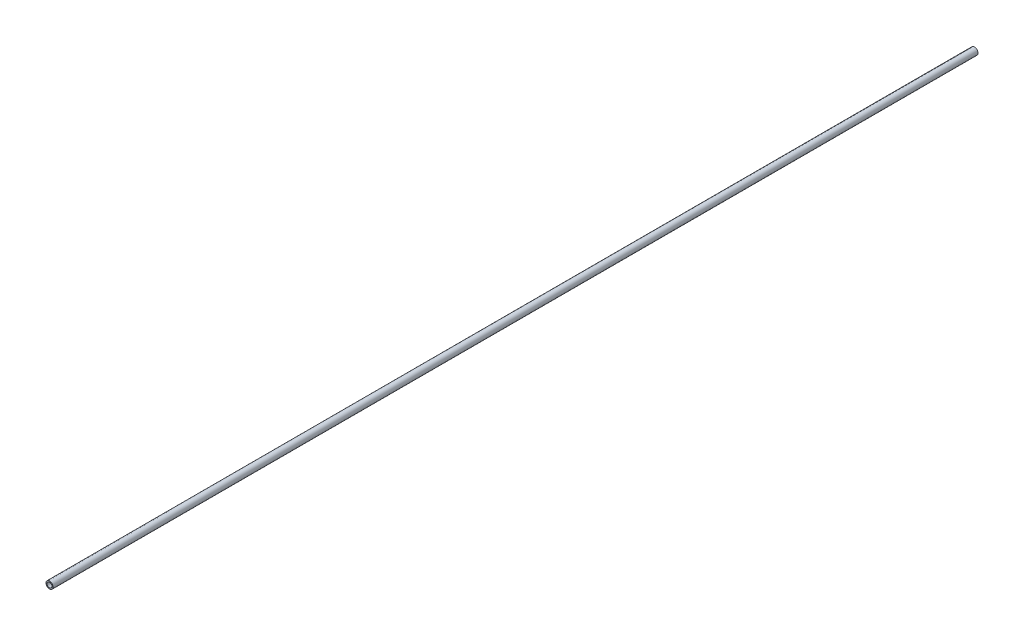
ISO-10303-21;
HEADER;
FILE_DESCRIPTION(('STEP AP214'),'2;1');
FILE_NAME('part.step','',(''),(''),'','','');
FILE_SCHEMA(('AUTOMOTIVE_DESIGN { 1 0 10303 214 1 1 1 1 }'));
ENDSEC;
DATA;
#1=APPLICATION_CONTEXT('core data for automotive mechanical design processes');
#2=APPLICATION_PROTOCOL_DEFINITION('international standard','automotive_design',2000,#1);
#3=PRODUCT_CONTEXT('',#1,'mechanical');
#4=PRODUCT('Part','Part','',(#3));
#5=PRODUCT_RELATED_PRODUCT_CATEGORY('part','',(#4));
#6=PRODUCT_DEFINITION_FORMATION('','',#4);
#7=PRODUCT_DEFINITION_CONTEXT('part definition',#1,'design');
#8=PRODUCT_DEFINITION('design','',#6,#7);
#9=PRODUCT_DEFINITION_SHAPE('','',#8);
#10=(LENGTH_UNIT() NAMED_UNIT(*) SI_UNIT(.MILLI.,.METRE.));
#11=(NAMED_UNIT(*) PLANE_ANGLE_UNIT() SI_UNIT($,.RADIAN.));
#12=(NAMED_UNIT(*) SI_UNIT($,.STERADIAN.) SOLID_ANGLE_UNIT());
#13=UNCERTAINTY_MEASURE_WITH_UNIT(LENGTH_MEASURE(1.E-05),#10,'distance_accuracy_value','');
#14=(GEOMETRIC_REPRESENTATION_CONTEXT(3) GLOBAL_UNCERTAINTY_ASSIGNED_CONTEXT((#13)) GLOBAL_UNIT_ASSIGNED_CONTEXT((#10,
#11,#12)) REPRESENTATION_CONTEXT('',''));
#15=CARTESIAN_POINT('',(0.,0.,0.));
#16=DIRECTION('',(0.,0.,1.));
#17=DIRECTION('',(1.,0.,0.));
#18=AXIS2_PLACEMENT_3D('',#15,#16,#17);
#19=CARTESIAN_POINT('',(0.,0.,-1799.55));
#20=DIRECTION('',(0.,0.,1.));
#21=DIRECTION('',(1.,0.,0.));
#22=AXIS2_PLACEMENT_3D('',#19,#20,#21);
#23=CYLINDRICAL_SURFACE('',#22,6.83635542);
#24=CARTESIAN_POINT('',(0.,0.,-1799.55));
#25=DIRECTION('',(0.,0.,1.));
#26=DIRECTION('',(1.,0.,0.));
#27=AXIS2_PLACEMENT_3D('',#24,#25,#26);
#28=CIRCLE('',#27,6.83635542);
#29=CARTESIAN_POINT('',(6.83635542,0.,-1799.55));
#30=VERTEX_POINT('',#29);
#31=EDGE_CURVE('E10',#30,#30,#28,.T.);
#32=ORIENTED_EDGE('',*,*,#31,.T.);
#33=EDGE_LOOP('',(#32));
#34=FACE_BOUND('',#33,.T.);
#35=CARTESIAN_POINT('',(0.,0.,0.));
#36=DIRECTION('',(0.,0.,1.));
#37=DIRECTION('',(1.,0.,0.));
#38=AXIS2_PLACEMENT_3D('',#35,#36,#37);
#39=CIRCLE('',#38,6.83635542);
#40=CARTESIAN_POINT('',(6.83635542,0.,0.));
#41=VERTEX_POINT('',#40);
#42=EDGE_CURVE('E38',#41,#41,#39,.T.);
#43=ORIENTED_EDGE('',*,*,#42,.F.);
#44=EDGE_LOOP('',(#43));
#45=FACE_BOUND('',#44,.T.);
#46=ADVANCED_FACE('F35',(#34,#45),#23,.T.);
#47=CARTESIAN_POINT('',(0.,0.,-1799.55));
#48=DIRECTION('',(0.,0.,1.));
#49=DIRECTION('',(1.,0.,0.));
#50=AXIS2_PLACEMENT_3D('',#47,#48,#49);
#51=PLANE('',#50);
#52=CARTESIAN_POINT('',(0.,0.,-1799.55));
#53=DIRECTION('',(0.,0.,1.));
#54=DIRECTION('',(1.,0.,0.));
#55=AXIS2_PLACEMENT_3D('',#52,#53,#54);
#56=CIRCLE('',#55,4.83635542);
#57=CARTESIAN_POINT('',(4.83635542,0.,-1799.55));
#58=VERTEX_POINT('',#57);
#59=EDGE_CURVE('E45',#58,#58,#56,.T.);
#60=ORIENTED_EDGE('',*,*,#59,.T.);
#61=EDGE_LOOP('',(#60));
#62=FACE_BOUND('',#61,.T.);
#63=ORIENTED_EDGE('',*,*,#31,.F.);
#64=EDGE_LOOP('',(#63));
#65=FACE_BOUND('',#64,.T.);
#66=ADVANCED_FACE('F53',(#62,#65),#51,.F.);
#67=CARTESIAN_POINT('',(0.,0.,0.));
#68=DIRECTION('',(0.,0.,1.));
#69=DIRECTION('',(1.,0.,0.));
#70=AXIS2_PLACEMENT_3D('',#67,#68,#69);
#71=PLANE('',#70);
#72=CARTESIAN_POINT('',(0.,0.,0.));
#73=DIRECTION('',(0.,0.,1.));
#74=DIRECTION('',(1.,0.,0.));
#75=AXIS2_PLACEMENT_3D('',#72,#73,#74);
#76=CIRCLE('',#75,4.83635542);
#77=CARTESIAN_POINT('',(4.83635542,0.,0.));
#78=VERTEX_POINT('',#77);
#79=EDGE_CURVE('E47',#78,#78,#76,.T.);
#80=ORIENTED_EDGE('',*,*,#79,.F.);
#81=EDGE_LOOP('',(#80));
#82=FACE_BOUND('',#81,.T.);
#83=ORIENTED_EDGE('',*,*,#42,.T.);
#84=EDGE_LOOP('',(#83));
#85=FACE_BOUND('',#84,.T.);
#86=ADVANCED_FACE('F59',(#82,#85),#71,.T.);
#87=CARTESIAN_POINT('',(0.,0.,-1799.55));
#88=DIRECTION('',(0.,0.,1.));
#89=DIRECTION('',(1.,0.,0.));
#90=AXIS2_PLACEMENT_3D('',#87,#88,#89);
#91=CYLINDRICAL_SURFACE('',#90,4.83635542);
#92=ORIENTED_EDGE('',*,*,#59,.F.);
#93=EDGE_LOOP('',(#92));
#94=FACE_BOUND('',#93,.T.);
#95=ORIENTED_EDGE('',*,*,#79,.T.);
#96=EDGE_LOOP('',(#95));
#97=FACE_BOUND('',#96,.T.);
#98=ADVANCED_FACE('F56',(#94,#97),#91,.F.);
#99=CLOSED_SHELL('',(#46,#66,#86,#98));
#100=MANIFOLD_SOLID_BREP('B2',#99);
#101=ADVANCED_BREP_SHAPE_REPRESENTATION('',(#18,#100),#14);
#102=SHAPE_DEFINITION_REPRESENTATION(#9,#101);
ENDSEC;
END-ISO-10303-21;
